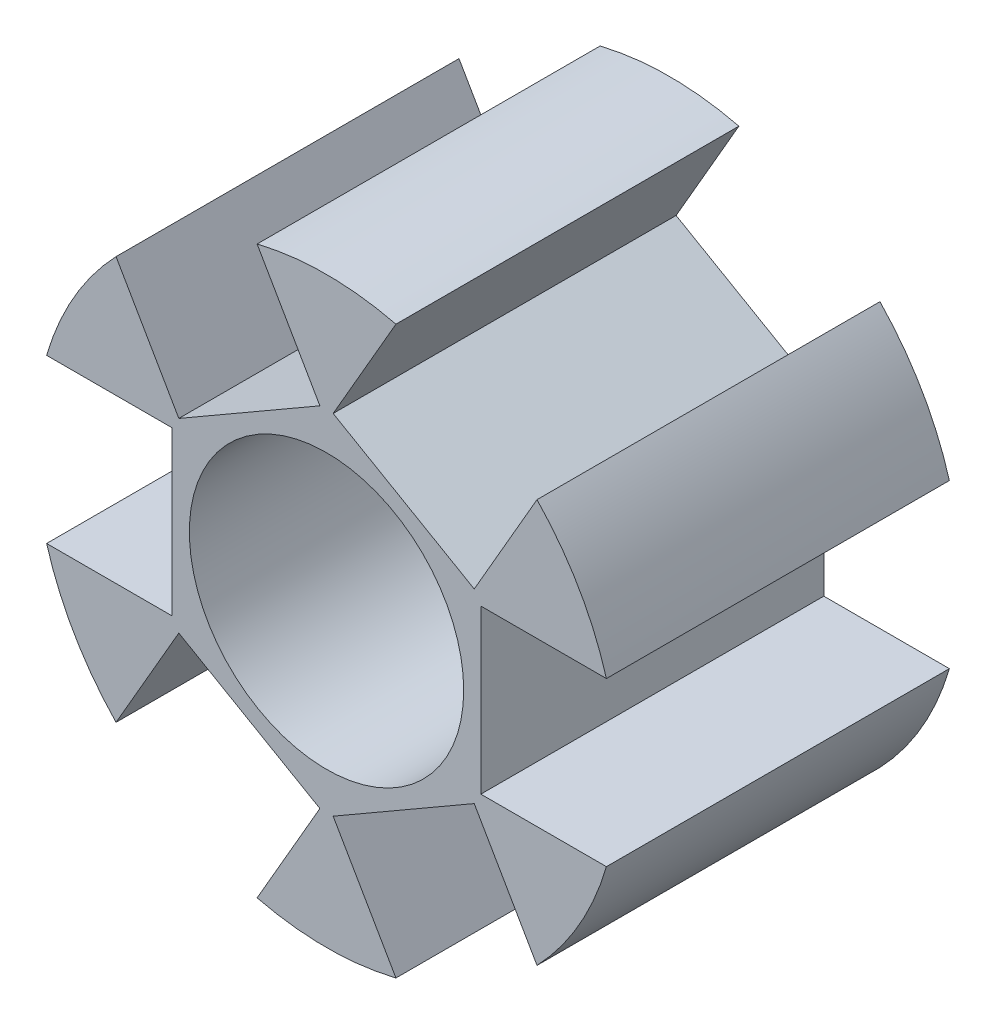
ISO-10303-21;
HEADER;
FILE_DESCRIPTION(('STEP AP214'),'2;1');
FILE_NAME('part.step','',(''),(''),'','','');
FILE_SCHEMA(('AUTOMOTIVE_DESIGN { 1 0 10303 214 1 1 1 1 }'));
ENDSEC;
DATA;
#1=APPLICATION_CONTEXT('core data for automotive mechanical design processes');
#2=APPLICATION_PROTOCOL_DEFINITION('international standard','automotive_design',2000,#1);
#3=PRODUCT_CONTEXT('',#1,'mechanical');
#4=PRODUCT('Part','Part','',(#3));
#5=PRODUCT_RELATED_PRODUCT_CATEGORY('part','',(#4));
#6=PRODUCT_DEFINITION_FORMATION('','',#4);
#7=PRODUCT_DEFINITION_CONTEXT('part definition',#1,'design');
#8=PRODUCT_DEFINITION('design','',#6,#7);
#9=PRODUCT_DEFINITION_SHAPE('','',#8);
#10=(LENGTH_UNIT() NAMED_UNIT(*) SI_UNIT(.MILLI.,.METRE.));
#11=(NAMED_UNIT(*) PLANE_ANGLE_UNIT() SI_UNIT($,.RADIAN.));
#12=(NAMED_UNIT(*) SI_UNIT($,.STERADIAN.) SOLID_ANGLE_UNIT());
#13=UNCERTAINTY_MEASURE_WITH_UNIT(LENGTH_MEASURE(1.E-05),#10,'distance_accuracy_value','');
#14=(GEOMETRIC_REPRESENTATION_CONTEXT(3) GLOBAL_UNCERTAINTY_ASSIGNED_CONTEXT((#13)) GLOBAL_UNIT_ASSIGNED_CONTEXT((#10,
#11,#12)) REPRESENTATION_CONTEXT('',''));
#15=CARTESIAN_POINT('',(0.,0.,0.));
#16=DIRECTION('',(0.,0.,1.));
#17=DIRECTION('',(1.,0.,0.));
#18=AXIS2_PLACEMENT_3D('',#15,#16,#17);
#19=CARTESIAN_POINT('',(0.,0.,5.));
#20=DIRECTION('',(0.,0.,1.));
#21=DIRECTION('',(1.,0.,0.));
#22=AXIS2_PLACEMENT_3D('',#19,#20,#21);
#23=PLANE('',#22);
#24=CARTESIAN_POINT('',(0.,0.,5.));
#25=DIRECTION('',(0.,0.,1.));
#26=DIRECTION('',(1.,0.,0.));
#27=AXIS2_PLACEMENT_3D('',#24,#25,#26);
#28=CIRCLE('',#27,4.);
#29=CARTESIAN_POINT('',(4.,0.,5.));
#30=VERTEX_POINT('',#29);
#31=EDGE_CURVE('E337',#30,#30,#28,.T.);
#32=ORIENTED_EDGE('',*,*,#31,.F.);
#33=EDGE_LOOP('',(#32));
#34=FACE_BOUND('',#33,.T.);
#35=DIRECTION('',(-0.866025403784433,-0.50000000000001,0.));
#36=VECTOR('',#35,1.);
#37=CARTESIAN_POINT('',(-0.193189666012014,5.08461431702997,5.));
#38=LINE('',#37,#36);
#39=CARTESIAN_POINT('',(-0.193189666012014,5.08461431702997,5.));
#40=VERTEX_POINT('',#39);
#41=CARTESIAN_POINT('',(-4.30681033398807,2.70961431702992,5.));
#42=VERTEX_POINT('',#41);
#43=EDGE_CURVE('E284',#40,#42,#38,.T.);
#44=ORIENTED_EDGE('',*,*,#43,.T.);
#45=DIRECTION('',(-0.50000000000001,0.866025403784433,0.));
#46=VECTOR('',#45,1.);
#47=CARTESIAN_POINT('',(-4.30681033398807,2.70961431702992,5.));
#48=LINE('',#47,#46);
#49=CARTESIAN_POINT('',(-6.13753866971447,5.88052880936397,5.));
#50=VERTEX_POINT('',#49);
#51=EDGE_CURVE('E287',#42,#50,#48,.T.);
#52=ORIENTED_EDGE('',*,*,#51,.T.);
#53=CARTESIAN_POINT('',(0.,0.,5.));
#54=DIRECTION('',(0.,0.,1.));
#55=DIRECTION('',(1.,0.,0.));
#56=AXIS2_PLACEMENT_3D('',#53,#54,#55);
#57=CIRCLE('',#56,8.5);
#58=CARTESIAN_POINT('',(-8.16145667145271,2.375,5.));
#59=VERTEX_POINT('',#58);
#60=EDGE_CURVE('E350',#50,#59,#57,.T.);
#61=ORIENTED_EDGE('',*,*,#60,.T.);
#62=DIRECTION('',(-1.,0.,0.));
#63=VECTOR('',#62,1.);
#64=CARTESIAN_POINT('',(-4.5,2.375,5.));
#65=LINE('',#64,#63);
#66=CARTESIAN_POINT('',(-4.5,2.375,5.));
#67=VERTEX_POINT('',#66);
#68=EDGE_CURVE('E330',#67,#59,#65,.T.);
#69=ORIENTED_EDGE('',*,*,#68,.F.);
#70=DIRECTION('',(0.,-1.,0.));
#71=VECTOR('',#70,1.);
#72=CARTESIAN_POINT('',(-4.5,2.375,5.));
#73=LINE('',#72,#71);
#74=CARTESIAN_POINT('',(-4.5,-2.375,5.));
#75=VERTEX_POINT('',#74);
#76=EDGE_CURVE('E321',#67,#75,#73,.T.);
#77=ORIENTED_EDGE('',*,*,#76,.T.);
#78=DIRECTION('',(-1.,0.,0.));
#79=VECTOR('',#78,1.);
#80=CARTESIAN_POINT('',(-4.5,-2.375,5.));
#81=LINE('',#80,#79);
#82=CARTESIAN_POINT('',(-8.16145667145271,-2.375,5.));
#83=VERTEX_POINT('',#82);
#84=EDGE_CURVE('E323',#75,#83,#81,.T.);
#85=ORIENTED_EDGE('',*,*,#84,.T.);
#86=CARTESIAN_POINT('',(-6.13753866971439,-5.88052880936405,5.));
#87=VERTEX_POINT('',#86);
#88=EDGE_CURVE('E342',#83,#87,#57,.T.);
#89=ORIENTED_EDGE('',*,*,#88,.T.);
#90=DIRECTION('',(-0.499999999999998,-0.86602540378444,0.));
#91=VECTOR('',#90,1.);
#92=CARTESIAN_POINT('',(-4.30681033398804,-2.70961431702998,5.));
#93=LINE('',#92,#91);
#94=CARTESIAN_POINT('',(-4.30681033398804,-2.70961431702998,5.));
#95=VERTEX_POINT('',#94);
#96=EDGE_CURVE('E306',#95,#87,#93,.T.);
#97=ORIENTED_EDGE('',*,*,#96,.F.);
#98=DIRECTION('',(0.86602540378444,-0.499999999999998,0.));
#99=VECTOR('',#98,1.);
#100=CARTESIAN_POINT('',(-4.30681033398804,-2.70961431702998,5.));
#101=LINE('',#100,#99);
#102=CARTESIAN_POINT('',(-0.193189666011946,-5.08461431702997,5.));
#103=VERTEX_POINT('',#102);
#104=EDGE_CURVE('E297',#95,#103,#101,.T.);
#105=ORIENTED_EDGE('',*,*,#104,.T.);
#106=DIRECTION('',(-0.499999999999998,-0.86602540378444,0.));
#107=VECTOR('',#106,1.);
#108=CARTESIAN_POINT('',(-0.193189666011946,-5.08461431702997,5.));
#109=LINE('',#108,#107);
#110=CARTESIAN_POINT('',(-2.0239180017383,-8.25552880936404,5.));
#111=VERTEX_POINT('',#110);
#112=EDGE_CURVE('E303',#103,#111,#109,.T.);
#113=ORIENTED_EDGE('',*,*,#112,.T.);
#114=CARTESIAN_POINT('',(2.02391800173835,-8.25552880936403,5.));
#115=VERTEX_POINT('',#114);
#116=EDGE_CURVE('E346',#111,#115,#57,.T.);
#117=ORIENTED_EDGE('',*,*,#116,.T.);
#118=DIRECTION('',(0.500000000000004,-0.866025403784436,0.));
#119=VECTOR('',#118,1.);
#120=CARTESIAN_POINT('',(0.193189666011979,-5.08461431702997,5.));
#121=LINE('',#120,#119);
#122=CARTESIAN_POINT('',(0.193189666011979,-5.08461431702997,5.));
#123=VERTEX_POINT('',#122);
#124=EDGE_CURVE('E231',#123,#115,#121,.T.);
#125=ORIENTED_EDGE('',*,*,#124,.F.);
#126=DIRECTION('',(0.866025403784436,0.500000000000004,0.));
#127=VECTOR('',#126,1.);
#128=CARTESIAN_POINT('',(0.193189666011979,-5.08461431702997,5.));
#129=LINE('',#128,#127);
#130=CARTESIAN_POINT('',(4.30681033398805,-2.70961431702995,5.));
#131=VERTEX_POINT('',#130);
#132=EDGE_CURVE('E516',#123,#131,#129,.T.);
#133=ORIENTED_EDGE('',*,*,#132,.T.);
#134=DIRECTION('',(0.500000000000004,-0.866025403784436,0.));
#135=VECTOR('',#134,1.);
#136=CARTESIAN_POINT('',(4.30681033398805,-2.70961431702995,5.));
#137=LINE('',#136,#135);
#138=CARTESIAN_POINT('',(6.13753866971443,-5.88052880936401,5.));
#139=VERTEX_POINT('',#138);
#140=EDGE_CURVE('E217',#131,#139,#137,.T.);
#141=ORIENTED_EDGE('',*,*,#140,.T.);
#142=CARTESIAN_POINT('',(8.16145667145271,-2.375,5.));
#143=VERTEX_POINT('',#142);
#144=EDGE_CURVE('E430',#139,#143,#57,.T.);
#145=ORIENTED_EDGE('',*,*,#144,.T.);
#146=DIRECTION('',(1.,0.,0.));
#147=VECTOR('',#146,1.);
#148=CARTESIAN_POINT('',(4.5,-2.375,5.));
#149=LINE('',#148,#147);
#150=CARTESIAN_POINT('',(4.5,-2.375,5.));
#151=VERTEX_POINT('',#150);
#152=EDGE_CURVE('E255',#151,#143,#149,.T.);
#153=ORIENTED_EDGE('',*,*,#152,.F.);
#154=DIRECTION('',(0.,1.,0.));
#155=VECTOR('',#154,1.);
#156=CARTESIAN_POINT('',(4.5,-2.375,5.));
#157=LINE('',#156,#155);
#158=CARTESIAN_POINT('',(4.5,2.375,5.));
#159=VERTEX_POINT('',#158);
#160=EDGE_CURVE('E246',#151,#159,#157,.T.);
#161=ORIENTED_EDGE('',*,*,#160,.T.);
#162=DIRECTION('',(1.,0.,0.));
#163=VECTOR('',#162,1.);
#164=CARTESIAN_POINT('',(4.5,2.375,5.));
#165=LINE('',#164,#163);
#166=CARTESIAN_POINT('',(8.16145667145271,2.375,5.));
#167=VERTEX_POINT('',#166);
#168=EDGE_CURVE('E248',#159,#167,#165,.T.);
#169=ORIENTED_EDGE('',*,*,#168,.T.);
#170=CARTESIAN_POINT('',(6.13753866971435,5.88052880936409,5.));
#171=VERTEX_POINT('',#170);
#172=EDGE_CURVE('E429',#167,#171,#57,.T.);
#173=ORIENTED_EDGE('',*,*,#172,.T.);
#174=DIRECTION('',(0.499999999999992,0.866025403784443,0.));
#175=VECTOR('',#174,1.);
#176=CARTESIAN_POINT('',(4.30681033398802,2.70961431703001,5.));
#177=LINE('',#176,#175);
#178=CARTESIAN_POINT('',(4.30681033398802,2.70961431703001,5.));
#179=VERTEX_POINT('',#178);
#180=EDGE_CURVE('E63',#179,#171,#177,.T.);
#181=ORIENTED_EDGE('',*,*,#180,.F.);
#182=DIRECTION('',(-0.866025403784443,0.499999999999992,0.));
#183=VECTOR('',#182,1.);
#184=CARTESIAN_POINT('',(4.30681033398802,2.70961431703001,5.));
#185=LINE('',#184,#183);
#186=CARTESIAN_POINT('',(0.19318966601191,5.08461431702997,5.));
#187=VERTEX_POINT('',#186);
#188=EDGE_CURVE('E266',#179,#187,#185,.T.);
#189=ORIENTED_EDGE('',*,*,#188,.T.);
#190=DIRECTION('',(0.499999999999992,0.866025403784443,0.));
#191=VECTOR('',#190,1.);
#192=CARTESIAN_POINT('',(0.19318966601191,5.08461431702997,5.));
#193=LINE('',#192,#191);
#194=CARTESIAN_POINT('',(2.02391800173824,8.25552880936405,5.));
#195=VERTEX_POINT('',#194);
#196=EDGE_CURVE('E268',#187,#195,#193,.T.);
#197=ORIENTED_EDGE('',*,*,#196,.T.);
#198=CARTESIAN_POINT('',(-2.02391800173841,8.25552880936401,5.));
#199=VERTEX_POINT('',#198);
#200=EDGE_CURVE('E433',#195,#199,#57,.T.);
#201=ORIENTED_EDGE('',*,*,#200,.T.);
#202=DIRECTION('',(-0.50000000000001,0.866025403784433,0.));
#203=VECTOR('',#202,1.);
#204=CARTESIAN_POINT('',(-0.193189666012014,5.08461431702997,5.));
#205=LINE('',#204,#203);
#206=EDGE_CURVE('E57',#40,#199,#205,.T.);
#207=ORIENTED_EDGE('',*,*,#206,.F.);
#208=EDGE_LOOP('',(#44,#52,#61,#69,#77,#85,#89,#97,#105,#113,#117,#125,#133,#141,#145,#153,#161,
#169,#173,#181,#189,#197,#201,#207));
#209=FACE_BOUND('',#208,.T.);
#210=ADVANCED_FACE('F41',(#34,#209),#23,.T.);
#211=CARTESIAN_POINT('',(0.,0.,-5.));
#212=DIRECTION('',(0.,0.,1.));
#213=DIRECTION('',(1.,0.,0.));
#214=AXIS2_PLACEMENT_3D('',#211,#212,#213);
#215=PLANE('',#214);
#216=CARTESIAN_POINT('',(0.,0.,-5.));
#217=DIRECTION('',(0.,0.,1.));
#218=DIRECTION('',(1.,0.,0.));
#219=AXIS2_PLACEMENT_3D('',#216,#217,#218);
#220=CIRCLE('',#219,4.);
#221=CARTESIAN_POINT('',(4.,0.,-5.));
#222=VERTEX_POINT('',#221);
#223=EDGE_CURVE('E334',#222,#222,#220,.T.);
#224=ORIENTED_EDGE('',*,*,#223,.T.);
#225=EDGE_LOOP('',(#224));
#226=FACE_BOUND('',#225,.T.);
#227=DIRECTION('',(-0.50000000000001,0.866025403784433,0.));
#228=VECTOR('',#227,1.);
#229=CARTESIAN_POINT('',(-4.30681033398807,2.70961431702992,-5.));
#230=LINE('',#229,#228);
#231=CARTESIAN_POINT('',(-4.30681033398807,2.70961431702992,-5.));
#232=VERTEX_POINT('',#231);
#233=CARTESIAN_POINT('',(-6.13753866971447,5.88052880936397,-5.));
#234=VERTEX_POINT('',#233);
#235=EDGE_CURVE('E261',#232,#234,#230,.T.);
#236=ORIENTED_EDGE('',*,*,#235,.F.);
#237=DIRECTION('',(0.866025403784433,0.50000000000001,0.));
#238=VECTOR('',#237,1.);
#239=CARTESIAN_POINT('',(-0.193189666012014,5.08461431702997,-5.));
#240=LINE('',#239,#238);
#241=CARTESIAN_POINT('',(-0.193189666012014,5.08461431702997,-5.));
#242=VERTEX_POINT('',#241);
#243=EDGE_CURVE('E280',#232,#242,#240,.T.);
#244=ORIENTED_EDGE('',*,*,#243,.T.);
#245=DIRECTION('',(-0.50000000000001,0.866025403784433,0.));
#246=VECTOR('',#245,1.);
#247=CARTESIAN_POINT('',(-0.193189666012014,5.08461431702997,-5.));
#248=LINE('',#247,#246);
#249=CARTESIAN_POINT('',(-2.02391800173841,8.25552880936401,-5.));
#250=VERTEX_POINT('',#249);
#251=EDGE_CURVE('E292',#242,#250,#248,.T.);
#252=ORIENTED_EDGE('',*,*,#251,.T.);
#253=CARTESIAN_POINT('',(0.,0.,-5.));
#254=DIRECTION('',(0.,0.,1.));
#255=DIRECTION('',(1.,0.,0.));
#256=AXIS2_PLACEMENT_3D('',#253,#254,#255);
#257=CIRCLE('',#256,8.5);
#258=CARTESIAN_POINT('',(2.02391800173824,8.25552880936405,-5.));
#259=VERTEX_POINT('',#258);
#260=EDGE_CURVE('E378',#259,#250,#257,.T.);
#261=ORIENTED_EDGE('',*,*,#260,.F.);
#262=DIRECTION('',(0.499999999999992,0.866025403784443,0.));
#263=VECTOR('',#262,1.);
#264=CARTESIAN_POINT('',(0.19318966601191,5.08461431702997,-5.));
#265=LINE('',#264,#263);
#266=CARTESIAN_POINT('',(0.19318966601191,5.08461431702997,-5.));
#267=VERTEX_POINT('',#266);
#268=EDGE_CURVE('E241',#267,#259,#265,.T.);
#269=ORIENTED_EDGE('',*,*,#268,.F.);
#270=DIRECTION('',(0.866025403784443,-0.499999999999992,0.));
#271=VECTOR('',#270,1.);
#272=CARTESIAN_POINT('',(4.30681033398802,2.70961431703001,-5.));
#273=LINE('',#272,#271);
#274=CARTESIAN_POINT('',(4.30681033398802,2.70961431703001,-5.));
#275=VERTEX_POINT('',#274);
#276=EDGE_CURVE('E260',#267,#275,#273,.T.);
#277=ORIENTED_EDGE('',*,*,#276,.T.);
#278=DIRECTION('',(0.499999999999992,0.866025403784443,0.));
#279=VECTOR('',#278,1.);
#280=CARTESIAN_POINT('',(4.30681033398802,2.70961431703001,-5.));
#281=LINE('',#280,#279);
#282=CARTESIAN_POINT('',(6.13753866971435,5.88052880936409,-5.));
#283=VERTEX_POINT('',#282);
#284=EDGE_CURVE('E271',#275,#283,#281,.T.);
#285=ORIENTED_EDGE('',*,*,#284,.T.);
#286=CARTESIAN_POINT('',(8.16145667145271,2.375,-5.));
#287=VERTEX_POINT('',#286);
#288=EDGE_CURVE('E385',#287,#283,#257,.T.);
#289=ORIENTED_EDGE('',*,*,#288,.F.);
#290=DIRECTION('',(1.,0.,0.));
#291=VECTOR('',#290,1.);
#292=CARTESIAN_POINT('',(4.5,2.375,-5.));
#293=LINE('',#292,#291);
#294=CARTESIAN_POINT('',(4.5,2.375,-5.));
#295=VERTEX_POINT('',#294);
#296=EDGE_CURVE('E218',#295,#287,#293,.T.);
#297=ORIENTED_EDGE('',*,*,#296,.F.);
#298=DIRECTION('',(0.,-1.,0.));
#299=VECTOR('',#298,1.);
#300=CARTESIAN_POINT('',(4.5,-2.375,-5.));
#301=LINE('',#300,#299);
#302=CARTESIAN_POINT('',(4.5,-2.375,-5.));
#303=VERTEX_POINT('',#302);
#304=EDGE_CURVE('E239',#295,#303,#301,.T.);
#305=ORIENTED_EDGE('',*,*,#304,.T.);
#306=DIRECTION('',(1.,0.,0.));
#307=VECTOR('',#306,1.);
#308=CARTESIAN_POINT('',(4.5,-2.375,-5.));
#309=LINE('',#308,#307);
#310=CARTESIAN_POINT('',(8.16145667145271,-2.375,-5.));
#311=VERTEX_POINT('',#310);
#312=EDGE_CURVE('E251',#303,#311,#309,.T.);
#313=ORIENTED_EDGE('',*,*,#312,.T.);
#314=CARTESIAN_POINT('',(6.13753866971443,-5.88052880936401,-5.));
#315=VERTEX_POINT('',#314);
#316=EDGE_CURVE('E228',#315,#311,#257,.T.);
#317=ORIENTED_EDGE('',*,*,#316,.F.);
#318=DIRECTION('',(0.500000000000004,-0.866025403784436,0.));
#319=VECTOR('',#318,1.);
#320=CARTESIAN_POINT('',(4.30681033398805,-2.70961431702995,-5.));
#321=LINE('',#320,#319);
#322=CARTESIAN_POINT('',(4.30681033398805,-2.70961431702995,-5.));
#323=VERTEX_POINT('',#322);
#324=EDGE_CURVE('E215',#323,#315,#321,.T.);
#325=ORIENTED_EDGE('',*,*,#324,.F.);
#326=DIRECTION('',(-0.866025403784436,-0.500000000000004,0.));
#327=VECTOR('',#326,1.);
#328=CARTESIAN_POINT('',(0.193189666011979,-5.08461431702997,-5.));
#329=LINE('',#328,#327);
#330=CARTESIAN_POINT('',(0.193189666011979,-5.08461431702997,-5.));
#331=VERTEX_POINT('',#330);
#332=EDGE_CURVE('E205',#323,#331,#329,.T.);
#333=ORIENTED_EDGE('',*,*,#332,.T.);
#334=DIRECTION('',(0.500000000000004,-0.866025403784436,0.));
#335=VECTOR('',#334,1.);
#336=CARTESIAN_POINT('',(0.193189666011979,-5.08461431702997,-5.));
#337=LINE('',#336,#335);
#338=CARTESIAN_POINT('',(2.02391800173835,-8.25552880936403,-5.));
#339=VERTEX_POINT('',#338);
#340=EDGE_CURVE('E226',#331,#339,#337,.T.);
#341=ORIENTED_EDGE('',*,*,#340,.T.);
#342=CARTESIAN_POINT('',(-2.0239180017383,-8.25552880936404,-5.));
#343=VERTEX_POINT('',#342);
#344=EDGE_CURVE('E351',#343,#339,#257,.T.);
#345=ORIENTED_EDGE('',*,*,#344,.F.);
#346=DIRECTION('',(-0.499999999999998,-0.86602540378444,0.));
#347=VECTOR('',#346,1.);
#348=CARTESIAN_POINT('',(-0.193189666011946,-5.08461431702997,-5.));
#349=LINE('',#348,#347);
#350=CARTESIAN_POINT('',(-0.193189666011946,-5.08461431702997,-5.));
#351=VERTEX_POINT('',#350);
#352=EDGE_CURVE('E311',#351,#343,#349,.T.);
#353=ORIENTED_EDGE('',*,*,#352,.F.);
#354=DIRECTION('',(-0.86602540378444,0.499999999999998,0.));
#355=VECTOR('',#354,1.);
#356=CARTESIAN_POINT('',(-4.30681033398804,-2.70961431702998,-5.));
#357=LINE('',#356,#355);
#358=CARTESIAN_POINT('',(-4.30681033398804,-2.70961431702998,-5.));
#359=VERTEX_POINT('',#358);
#360=EDGE_CURVE('E233',#351,#359,#357,.T.);
#361=ORIENTED_EDGE('',*,*,#360,.T.);
#362=DIRECTION('',(-0.499999999999998,-0.86602540378444,0.));
#363=VECTOR('',#362,1.);
#364=CARTESIAN_POINT('',(-4.30681033398804,-2.70961431702998,-5.));
#365=LINE('',#364,#363);
#366=CARTESIAN_POINT('',(-6.13753866971439,-5.88052880936405,-5.));
#367=VERTEX_POINT('',#366);
#368=EDGE_CURVE('E308',#359,#367,#365,.T.);
#369=ORIENTED_EDGE('',*,*,#368,.T.);
#370=CARTESIAN_POINT('',(-8.16145667145271,-2.375,-5.));
#371=VERTEX_POINT('',#370);
#372=EDGE_CURVE('E347',#371,#367,#257,.T.);
#373=ORIENTED_EDGE('',*,*,#372,.F.);
#374=DIRECTION('',(-1.,0.,0.));
#375=VECTOR('',#374,1.);
#376=CARTESIAN_POINT('',(-4.5,-2.375,-5.));
#377=LINE('',#376,#375);
#378=CARTESIAN_POINT('',(-4.5,-2.375,-5.));
#379=VERTEX_POINT('',#378);
#380=EDGE_CURVE('E332',#379,#371,#377,.T.);
#381=ORIENTED_EDGE('',*,*,#380,.F.);
#382=DIRECTION('',(0.,1.,0.));
#383=VECTOR('',#382,1.);
#384=CARTESIAN_POINT('',(-4.5,2.375,-5.));
#385=LINE('',#384,#383);
#386=CARTESIAN_POINT('',(-4.5,2.375,-5.));
#387=VERTEX_POINT('',#386);
#388=EDGE_CURVE('E317',#379,#387,#385,.T.);
#389=ORIENTED_EDGE('',*,*,#388,.T.);
#390=DIRECTION('',(-1.,0.,0.));
#391=VECTOR('',#390,1.);
#392=CARTESIAN_POINT('',(-4.5,2.375,-5.));
#393=LINE('',#392,#391);
#394=CARTESIAN_POINT('',(-8.16145667145271,2.375,-5.));
#395=VERTEX_POINT('',#394);
#396=EDGE_CURVE('E329',#387,#395,#393,.T.);
#397=ORIENTED_EDGE('',*,*,#396,.T.);
#398=EDGE_CURVE('E339',#234,#395,#257,.T.);
#399=ORIENTED_EDGE('',*,*,#398,.F.);
#400=EDGE_LOOP('',(#236,#244,#252,#261,#269,#277,#285,#289,#297,#305,#313,#317,#325,#333,#341,
#345,#353,#361,#369,#373,#381,#389,#397,#399));
#401=FACE_BOUND('',#400,.T.);
#402=ADVANCED_FACE('F222',(#226,#401),#215,.F.);
#403=CARTESIAN_POINT('',(0.,0.,5.));
#404=DIRECTION('',(0.,0.,-1.));
#405=DIRECTION('',(-1.,0.,0.));
#406=AXIS2_PLACEMENT_3D('',#403,#404,#405);
#407=CYLINDRICAL_SURFACE('',#406,8.5);
#408=DIRECTION('',(0.,0.,-1.));
#409=VECTOR('',#408,1.);
#410=CARTESIAN_POINT('',(-6.13753866971447,5.88052880936397,5.));
#411=LINE('',#410,#409);
#412=EDGE_CURVE('E11',#234,#50,#411,.F.);
#413=ORIENTED_EDGE('',*,*,#412,.F.);
#414=ORIENTED_EDGE('',*,*,#398,.T.);
#415=DIRECTION('',(0.,0.,-1.));
#416=VECTOR('',#415,1.);
#417=CARTESIAN_POINT('',(-8.16145667145271,2.375,5.));
#418=LINE('',#417,#416);
#419=EDGE_CURVE('E345',#59,#395,#418,.T.);
#420=ORIENTED_EDGE('',*,*,#419,.F.);
#421=ORIENTED_EDGE('',*,*,#60,.F.);
#422=EDGE_LOOP('',(#413,#414,#420,#421));
#423=FACE_BOUND('',#422,.T.);
#424=ADVANCED_FACE('F43',(#423),#407,.T.);
#425=DIRECTION('',(0.,0.,-1.));
#426=VECTOR('',#425,1.);
#427=CARTESIAN_POINT('',(-2.02391800173841,8.25552880936401,5.));
#428=LINE('',#427,#426);
#429=EDGE_CURVE('E47',#199,#250,#428,.T.);
#430=ORIENTED_EDGE('',*,*,#429,.F.);
#431=ORIENTED_EDGE('',*,*,#200,.F.);
#432=DIRECTION('',(0.,0.,-1.));
#433=VECTOR('',#432,1.);
#434=CARTESIAN_POINT('',(2.02391800173824,8.25552880936405,5.));
#435=LINE('',#434,#433);
#436=EDGE_CURVE('E369',#259,#195,#435,.F.);
#437=ORIENTED_EDGE('',*,*,#436,.F.);
#438=ORIENTED_EDGE('',*,*,#260,.T.);
#439=EDGE_LOOP('',(#430,#431,#437,#438));
#440=FACE_BOUND('',#439,.T.);
#441=ADVANCED_FACE('F382',(#440),#407,.T.);
#442=DIRECTION('',(0.,0.,-1.));
#443=VECTOR('',#442,1.);
#444=CARTESIAN_POINT('',(6.13753866971435,5.88052880936409,5.));
#445=LINE('',#444,#443);
#446=EDGE_CURVE('E368',#171,#283,#445,.T.);
#447=ORIENTED_EDGE('',*,*,#446,.F.);
#448=ORIENTED_EDGE('',*,*,#172,.F.);
#449=DIRECTION('',(0.,0.,-1.));
#450=VECTOR('',#449,1.);
#451=CARTESIAN_POINT('',(8.16145667145271,2.375,5.));
#452=LINE('',#451,#450);
#453=EDGE_CURVE('E366',#287,#167,#452,.F.);
#454=ORIENTED_EDGE('',*,*,#453,.F.);
#455=ORIENTED_EDGE('',*,*,#288,.T.);
#456=EDGE_LOOP('',(#447,#448,#454,#455));
#457=FACE_BOUND('',#456,.T.);
#458=ADVANCED_FACE('F504',(#457),#407,.T.);
#459=DIRECTION('',(0.,0.,-1.));
#460=VECTOR('',#459,1.);
#461=CARTESIAN_POINT('',(8.16145667145271,-2.375,5.));
#462=LINE('',#461,#460);
#463=EDGE_CURVE('E364',#143,#311,#462,.T.);
#464=ORIENTED_EDGE('',*,*,#463,.F.);
#465=ORIENTED_EDGE('',*,*,#144,.F.);
#466=DIRECTION('',(0.,0.,-1.));
#467=VECTOR('',#466,1.);
#468=CARTESIAN_POINT('',(6.13753866971443,-5.88052880936401,5.));
#469=LINE('',#468,#467);
#470=EDGE_CURVE('E365',#315,#139,#469,.F.);
#471=ORIENTED_EDGE('',*,*,#470,.F.);
#472=ORIENTED_EDGE('',*,*,#316,.T.);
#473=EDGE_LOOP('',(#464,#465,#471,#472));
#474=FACE_BOUND('',#473,.T.);
#475=ADVANCED_FACE('F514',(#474),#407,.T.);
#476=DIRECTION('',(0.,0.,-1.));
#477=VECTOR('',#476,1.);
#478=CARTESIAN_POINT('',(2.02391800173835,-8.25552880936403,5.));
#479=LINE('',#478,#477);
#480=EDGE_CURVE('E359',#115,#339,#479,.T.);
#481=ORIENTED_EDGE('',*,*,#480,.F.);
#482=ORIENTED_EDGE('',*,*,#116,.F.);
#483=DIRECTION('',(0.,0.,-1.));
#484=VECTOR('',#483,1.);
#485=CARTESIAN_POINT('',(-2.0239180017383,-8.25552880936404,5.));
#486=LINE('',#485,#484);
#487=EDGE_CURVE('E356',#343,#111,#486,.F.);
#488=ORIENTED_EDGE('',*,*,#487,.F.);
#489=ORIENTED_EDGE('',*,*,#344,.T.);
#490=EDGE_LOOP('',(#481,#482,#488,#489));
#491=FACE_BOUND('',#490,.T.);
#492=ADVANCED_FACE('F424',(#491),#407,.T.);
#493=DIRECTION('',(0.,0.,-1.));
#494=VECTOR('',#493,1.);
#495=CARTESIAN_POINT('',(-6.13753866971439,-5.88052880936405,5.));
#496=LINE('',#495,#494);
#497=EDGE_CURVE('E358',#87,#367,#496,.T.);
#498=ORIENTED_EDGE('',*,*,#497,.F.);
#499=ORIENTED_EDGE('',*,*,#88,.F.);
#500=DIRECTION('',(0.,0.,-1.));
#501=VECTOR('',#500,1.);
#502=CARTESIAN_POINT('',(-8.16145667145271,-2.375,5.));
#503=LINE('',#502,#501);
#504=EDGE_CURVE('E353',#371,#83,#503,.F.);
#505=ORIENTED_EDGE('',*,*,#504,.F.);
#506=ORIENTED_EDGE('',*,*,#372,.T.);
#507=EDGE_LOOP('',(#498,#499,#505,#506));
#508=FACE_BOUND('',#507,.T.);
#509=ADVANCED_FACE('F407',(#508),#407,.T.);
#510=CARTESIAN_POINT('',(0.,0.,5.));
#511=DIRECTION('',(0.,0.,-1.));
#512=DIRECTION('',(-1.,0.,0.));
#513=AXIS2_PLACEMENT_3D('',#510,#511,#512);
#514=CYLINDRICAL_SURFACE('',#513,4.);
#515=ORIENTED_EDGE('',*,*,#31,.T.);
#516=EDGE_LOOP('',(#515));
#517=FACE_BOUND('',#516,.T.);
#518=ORIENTED_EDGE('',*,*,#223,.F.);
#519=EDGE_LOOP('',(#518));
#520=FACE_BOUND('',#519,.T.);
#521=ADVANCED_FACE('F457',(#517,#520),#514,.F.);
#522=CARTESIAN_POINT('',(-4.5,-2.375,5.));
#523=DIRECTION('',(0.,1.,0.));
#524=DIRECTION('',(0.,0.,1.));
#525=AXIS2_PLACEMENT_3D('',#522,#523,#524);
#526=PLANE('',#525);
#527=ORIENTED_EDGE('',*,*,#504,.T.);
#528=ORIENTED_EDGE('',*,*,#84,.F.);
#529=DIRECTION('',(0.,0.,-1.));
#530=VECTOR('',#529,1.);
#531=CARTESIAN_POINT('',(-4.5,-2.375,5.));
#532=LINE('',#531,#530);
#533=EDGE_CURVE('E312',#75,#379,#532,.T.);
#534=ORIENTED_EDGE('',*,*,#533,.T.);
#535=ORIENTED_EDGE('',*,*,#380,.T.);
#536=EDGE_LOOP('',(#527,#528,#534,#535));
#537=FACE_BOUND('',#536,.T.);
#538=ADVANCED_FACE('F399',(#537),#526,.T.);
#539=CARTESIAN_POINT('',(-4.5,2.375,5.));
#540=DIRECTION('',(0.,-1.,0.));
#541=DIRECTION('',(0.,0.,-1.));
#542=AXIS2_PLACEMENT_3D('',#539,#540,#541);
#543=PLANE('',#542);
#544=ORIENTED_EDGE('',*,*,#419,.T.);
#545=ORIENTED_EDGE('',*,*,#396,.F.);
#546=DIRECTION('',(0.,0.,1.));
#547=VECTOR('',#546,1.);
#548=CARTESIAN_POINT('',(-4.5,2.375,5.));
#549=LINE('',#548,#547);
#550=EDGE_CURVE('E316',#387,#67,#549,.T.);
#551=ORIENTED_EDGE('',*,*,#550,.T.);
#552=ORIENTED_EDGE('',*,*,#68,.T.);
#553=EDGE_LOOP('',(#544,#545,#551,#552));
#554=FACE_BOUND('',#553,.T.);
#555=ADVANCED_FACE('F390',(#554),#543,.T.);
#556=CARTESIAN_POINT('',(-4.5,0.,0.));
#557=DIRECTION('',(-1.,0.,0.));
#558=DIRECTION('',(0.,0.,1.));
#559=AXIS2_PLACEMENT_3D('',#556,#557,#558);
#560=PLANE('',#559);
#561=ORIENTED_EDGE('',*,*,#533,.F.);
#562=ORIENTED_EDGE('',*,*,#76,.F.);
#563=ORIENTED_EDGE('',*,*,#550,.F.);
#564=ORIENTED_EDGE('',*,*,#388,.F.);
#565=EDGE_LOOP('',(#561,#562,#563,#564));
#566=FACE_BOUND('',#565,.T.);
#567=ADVANCED_FACE('F400',(#566),#560,.T.);
#568=CARTESIAN_POINT('',(-0.193189666011946,-5.08461431702997,5.));
#569=DIRECTION('',(-0.86602540378444,0.499999999999998,0.));
#570=DIRECTION('',(-0.499999999999998,-0.86602540378444,0.));
#571=AXIS2_PLACEMENT_3D('',#568,#569,#570);
#572=PLANE('',#571);
#573=ORIENTED_EDGE('',*,*,#487,.T.);
#574=ORIENTED_EDGE('',*,*,#112,.F.);
#575=DIRECTION('',(0.,0.,-1.));
#576=VECTOR('',#575,1.);
#577=CARTESIAN_POINT('',(-0.193189666011946,-5.08461431702997,5.));
#578=LINE('',#577,#576);
#579=EDGE_CURVE('E227',#103,#351,#578,.T.);
#580=ORIENTED_EDGE('',*,*,#579,.T.);
#581=ORIENTED_EDGE('',*,*,#352,.T.);
#582=EDGE_LOOP('',(#573,#574,#580,#581));
#583=FACE_BOUND('',#582,.T.);
#584=ADVANCED_FACE('F417',(#583),#572,.T.);
#585=CARTESIAN_POINT('',(-4.30681033398804,-2.70961431702998,5.));
#586=DIRECTION('',(0.86602540378444,-0.499999999999998,0.));
#587=DIRECTION('',(0.499999999999998,0.86602540378444,0.));
#588=AXIS2_PLACEMENT_3D('',#585,#586,#587);
#589=PLANE('',#588);
#590=ORIENTED_EDGE('',*,*,#497,.T.);
#591=ORIENTED_EDGE('',*,*,#368,.F.);
#592=DIRECTION('',(0.,0.,1.));
#593=VECTOR('',#592,1.);
#594=CARTESIAN_POINT('',(-4.30681033398804,-2.70961431702998,5.));
#595=LINE('',#594,#593);
#596=EDGE_CURVE('E296',#359,#95,#595,.T.);
#597=ORIENTED_EDGE('',*,*,#596,.T.);
#598=ORIENTED_EDGE('',*,*,#96,.T.);
#599=EDGE_LOOP('',(#590,#591,#597,#598));
#600=FACE_BOUND('',#599,.T.);
#601=ADVANCED_FACE('F408',(#600),#589,.T.);
#602=CARTESIAN_POINT('',(-2.24999999999999,-3.89711431702998,0.));
#603=DIRECTION('',(-0.499999999999998,-0.86602540378444,0.));
#604=DIRECTION('',(0.,0.,1.));
#605=AXIS2_PLACEMENT_3D('',#602,#603,#604);
#606=PLANE('',#605);
#607=ORIENTED_EDGE('',*,*,#579,.F.);
#608=ORIENTED_EDGE('',*,*,#104,.F.);
#609=ORIENTED_EDGE('',*,*,#596,.F.);
#610=ORIENTED_EDGE('',*,*,#360,.F.);
#611=EDGE_LOOP('',(#607,#608,#609,#610));
#612=FACE_BOUND('',#611,.T.);
#613=ADVANCED_FACE('F414',(#612),#606,.T.);
#614=CARTESIAN_POINT('',(4.30681033398805,-2.70961431702995,5.));
#615=DIRECTION('',(-0.866025403784436,-0.500000000000004,0.));
#616=DIRECTION('',(0.500000000000004,-0.866025403784436,0.));
#617=AXIS2_PLACEMENT_3D('',#614,#615,#616);
#618=PLANE('',#617);
#619=ORIENTED_EDGE('',*,*,#470,.T.);
#620=ORIENTED_EDGE('',*,*,#140,.F.);
#621=DIRECTION('',(0.,0.,-1.));
#622=VECTOR('',#621,1.);
#623=CARTESIAN_POINT('',(4.30681033398805,-2.70961431702995,5.));
#624=LINE('',#623,#622);
#625=EDGE_CURVE('E207',#131,#323,#624,.T.);
#626=ORIENTED_EDGE('',*,*,#625,.T.);
#627=ORIENTED_EDGE('',*,*,#324,.T.);
#628=EDGE_LOOP('',(#619,#620,#626,#627));
#629=FACE_BOUND('',#628,.T.);
#630=ADVANCED_FACE('F213',(#629),#618,.T.);
#631=CARTESIAN_POINT('',(0.193189666011979,-5.08461431702997,5.));
#632=DIRECTION('',(0.866025403784436,0.500000000000004,0.));
#633=DIRECTION('',(-0.500000000000004,0.866025403784436,0.));
#634=AXIS2_PLACEMENT_3D('',#631,#632,#633);
#635=PLANE('',#634);
#636=ORIENTED_EDGE('',*,*,#480,.T.);
#637=ORIENTED_EDGE('',*,*,#340,.F.);
#638=DIRECTION('',(0.,0.,1.));
#639=VECTOR('',#638,1.);
#640=CARTESIAN_POINT('',(0.193189666011979,-5.08461431702997,5.));
#641=LINE('',#640,#639);
#642=EDGE_CURVE('E206',#331,#123,#641,.T.);
#643=ORIENTED_EDGE('',*,*,#642,.T.);
#644=ORIENTED_EDGE('',*,*,#124,.T.);
#645=EDGE_LOOP('',(#636,#637,#643,#644));
#646=FACE_BOUND('',#645,.T.);
#647=ADVANCED_FACE('F513',(#646),#635,.T.);
#648=CARTESIAN_POINT('',(2.25000000000002,-3.89711431702996,0.));
#649=DIRECTION('',(0.500000000000004,-0.866025403784436,0.));
#650=DIRECTION('',(0.,0.,1.));
#651=AXIS2_PLACEMENT_3D('',#648,#649,#650);
#652=PLANE('',#651);
#653=ORIENTED_EDGE('',*,*,#625,.F.);
#654=ORIENTED_EDGE('',*,*,#132,.F.);
#655=ORIENTED_EDGE('',*,*,#642,.F.);
#656=ORIENTED_EDGE('',*,*,#332,.F.);
#657=EDGE_LOOP('',(#653,#654,#655,#656));
#658=FACE_BOUND('',#657,.T.);
#659=ADVANCED_FACE('F203',(#658),#652,.T.);
#660=CARTESIAN_POINT('',(4.5,2.375,5.));
#661=DIRECTION('',(0.,-1.,0.));
#662=DIRECTION('',(0.,0.,-1.));
#663=AXIS2_PLACEMENT_3D('',#660,#661,#662);
#664=PLANE('',#663);
#665=ORIENTED_EDGE('',*,*,#453,.T.);
#666=ORIENTED_EDGE('',*,*,#168,.F.);
#667=DIRECTION('',(0.,0.,-1.));
#668=VECTOR('',#667,1.);
#669=CARTESIAN_POINT('',(4.5,2.375,5.));
#670=LINE('',#669,#668);
#671=EDGE_CURVE('E240',#159,#295,#670,.T.);
#672=ORIENTED_EDGE('',*,*,#671,.T.);
#673=ORIENTED_EDGE('',*,*,#296,.T.);
#674=EDGE_LOOP('',(#665,#666,#672,#673));
#675=FACE_BOUND('',#674,.T.);
#676=ADVANCED_FACE('F486',(#675),#664,.T.);
#677=CARTESIAN_POINT('',(4.5,-2.375,5.));
#678=DIRECTION('',(0.,1.,0.));
#679=DIRECTION('',(0.,0.,1.));
#680=AXIS2_PLACEMENT_3D('',#677,#678,#679);
#681=PLANE('',#680);
#682=ORIENTED_EDGE('',*,*,#463,.T.);
#683=ORIENTED_EDGE('',*,*,#312,.F.);
#684=DIRECTION('',(0.,0.,1.));
#685=VECTOR('',#684,1.);
#686=CARTESIAN_POINT('',(4.5,-2.375,5.));
#687=LINE('',#686,#685);
#688=EDGE_CURVE('E242',#303,#151,#687,.T.);
#689=ORIENTED_EDGE('',*,*,#688,.T.);
#690=ORIENTED_EDGE('',*,*,#152,.T.);
#691=EDGE_LOOP('',(#682,#683,#689,#690));
#692=FACE_BOUND('',#691,.T.);
#693=ADVANCED_FACE('F496',(#692),#681,.T.);
#694=CARTESIAN_POINT('',(4.5,0.,0.));
#695=DIRECTION('',(1.,0.,0.));
#696=DIRECTION('',(0.,0.,1.));
#697=AXIS2_PLACEMENT_3D('',#694,#695,#696);
#698=PLANE('',#697);
#699=ORIENTED_EDGE('',*,*,#671,.F.);
#700=ORIENTED_EDGE('',*,*,#160,.F.);
#701=ORIENTED_EDGE('',*,*,#688,.F.);
#702=ORIENTED_EDGE('',*,*,#304,.F.);
#703=EDGE_LOOP('',(#699,#700,#701,#702));
#704=FACE_BOUND('',#703,.T.);
#705=ADVANCED_FACE('F493',(#704),#698,.T.);
#706=CARTESIAN_POINT('',(0.19318966601191,5.08461431702997,5.));
#707=DIRECTION('',(0.866025403784443,-0.499999999999992,0.));
#708=DIRECTION('',(0.499999999999992,0.866025403784443,0.));
#709=AXIS2_PLACEMENT_3D('',#706,#707,#708);
#710=PLANE('',#709);
#711=ORIENTED_EDGE('',*,*,#436,.T.);
#712=ORIENTED_EDGE('',*,*,#196,.F.);
#713=DIRECTION('',(0.,0.,-1.));
#714=VECTOR('',#713,1.);
#715=CARTESIAN_POINT('',(0.19318966601191,5.08461431702997,5.));
#716=LINE('',#715,#714);
#717=EDGE_CURVE('E257',#187,#267,#716,.T.);
#718=ORIENTED_EDGE('',*,*,#717,.T.);
#719=ORIENTED_EDGE('',*,*,#268,.T.);
#720=EDGE_LOOP('',(#711,#712,#718,#719));
#721=FACE_BOUND('',#720,.T.);
#722=ADVANCED_FACE('F483',(#721),#710,.T.);
#723=CARTESIAN_POINT('',(4.30681033398802,2.70961431703001,5.));
#724=DIRECTION('',(-0.866025403784443,0.499999999999992,0.));
#725=DIRECTION('',(-0.499999999999992,-0.866025403784443,0.));
#726=AXIS2_PLACEMENT_3D('',#723,#724,#725);
#727=PLANE('',#726);
#728=ORIENTED_EDGE('',*,*,#446,.T.);
#729=ORIENTED_EDGE('',*,*,#284,.F.);
#730=DIRECTION('',(0.,0.,1.));
#731=VECTOR('',#730,1.);
#732=CARTESIAN_POINT('',(4.30681033398802,2.70961431703001,5.));
#733=LINE('',#732,#731);
#734=EDGE_CURVE('E263',#275,#179,#733,.T.);
#735=ORIENTED_EDGE('',*,*,#734,.T.);
#736=ORIENTED_EDGE('',*,*,#180,.T.);
#737=EDGE_LOOP('',(#728,#729,#735,#736));
#738=FACE_BOUND('',#737,.T.);
#739=ADVANCED_FACE('F477',(#738),#727,.T.);
#740=CARTESIAN_POINT('',(2.24999999999996,3.89711431702999,0.));
#741=DIRECTION('',(0.499999999999992,0.866025403784443,0.));
#742=DIRECTION('',(0.,0.,1.));
#743=AXIS2_PLACEMENT_3D('',#740,#741,#742);
#744=PLANE('',#743);
#745=ORIENTED_EDGE('',*,*,#717,.F.);
#746=ORIENTED_EDGE('',*,*,#188,.F.);
#747=ORIENTED_EDGE('',*,*,#734,.F.);
#748=ORIENTED_EDGE('',*,*,#276,.F.);
#749=EDGE_LOOP('',(#745,#746,#747,#748));
#750=FACE_BOUND('',#749,.T.);
#751=ADVANCED_FACE('F473',(#750),#744,.T.);
#752=CARTESIAN_POINT('',(-4.30681033398807,2.70961431702992,5.));
#753=DIRECTION('',(0.866025403784433,0.50000000000001,0.));
#754=DIRECTION('',(-0.50000000000001,0.866025403784433,0.));
#755=AXIS2_PLACEMENT_3D('',#752,#753,#754);
#756=PLANE('',#755);
#757=ORIENTED_EDGE('',*,*,#412,.T.);
#758=ORIENTED_EDGE('',*,*,#51,.F.);
#759=DIRECTION('',(0.,0.,-1.));
#760=VECTOR('',#759,1.);
#761=CARTESIAN_POINT('',(-4.30681033398807,2.70961431702992,5.));
#762=LINE('',#761,#760);
#763=EDGE_CURVE('E277',#42,#232,#762,.T.);
#764=ORIENTED_EDGE('',*,*,#763,.T.);
#765=ORIENTED_EDGE('',*,*,#235,.T.);
#766=EDGE_LOOP('',(#757,#758,#764,#765));
#767=FACE_BOUND('',#766,.T.);
#768=ADVANCED_FACE('F438',(#767),#756,.T.);
#769=CARTESIAN_POINT('',(-0.193189666012014,5.08461431702997,5.));
#770=DIRECTION('',(-0.866025403784433,-0.50000000000001,0.));
#771=DIRECTION('',(0.50000000000001,-0.866025403784433,0.));
#772=AXIS2_PLACEMENT_3D('',#769,#770,#771);
#773=PLANE('',#772);
#774=ORIENTED_EDGE('',*,*,#429,.T.);
#775=ORIENTED_EDGE('',*,*,#251,.F.);
#776=DIRECTION('',(0.,0.,1.));
#777=VECTOR('',#776,1.);
#778=CARTESIAN_POINT('',(-0.193189666012014,5.08461431702997,5.));
#779=LINE('',#778,#777);
#780=EDGE_CURVE('E282',#242,#40,#779,.T.);
#781=ORIENTED_EDGE('',*,*,#780,.T.);
#782=ORIENTED_EDGE('',*,*,#206,.T.);
#783=EDGE_LOOP('',(#774,#775,#781,#782));
#784=FACE_BOUND('',#783,.T.);
#785=ADVANCED_FACE('F371',(#784),#773,.T.);
#786=CARTESIAN_POINT('',(-2.25000000000004,3.89711431702995,0.));
#787=DIRECTION('',(-0.50000000000001,0.866025403784433,0.));
#788=DIRECTION('',(0.,0.,1.));
#789=AXIS2_PLACEMENT_3D('',#786,#787,#788);
#790=PLANE('',#789);
#791=ORIENTED_EDGE('',*,*,#763,.F.);
#792=ORIENTED_EDGE('',*,*,#43,.F.);
#793=ORIENTED_EDGE('',*,*,#780,.F.);
#794=ORIENTED_EDGE('',*,*,#243,.F.);
#795=EDGE_LOOP('',(#791,#792,#793,#794));
#796=FACE_BOUND('',#795,.T.);
#797=ADVANCED_FACE('F439',(#796),#790,.T.);
#798=CLOSED_SHELL('',(#210,#402,#424,#441,#458,#475,#492,#509,#521,#538,#555,#567,#584,#601,
#613,#630,#647,#659,#676,#693,#705,#722,#739,#751,#768,#785,#797));
#799=MANIFOLD_SOLID_BREP('B2',#798);
#800=ADVANCED_BREP_SHAPE_REPRESENTATION('',(#18,#799),#14);
#801=SHAPE_DEFINITION_REPRESENTATION(#9,#800);
ENDSEC;
END-ISO-10303-21;
